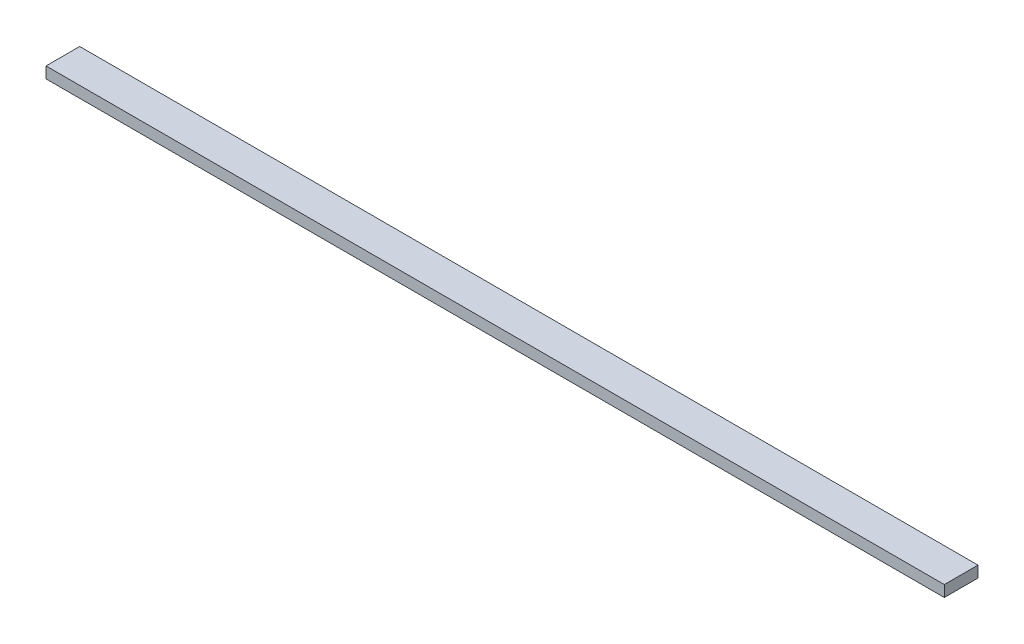
ISO-10303-21;
HEADER;
FILE_DESCRIPTION(('STEP AP214'),'2;1');
FILE_NAME('part.step','',(''),(''),'','','');
FILE_SCHEMA(('AUTOMOTIVE_DESIGN { 1 0 10303 214 1 1 1 1 }'));
ENDSEC;
DATA;
#1=APPLICATION_CONTEXT('core data for automotive mechanical design processes');
#2=APPLICATION_PROTOCOL_DEFINITION('international standard','automotive_design',2000,#1);
#3=PRODUCT_CONTEXT('',#1,'mechanical');
#4=PRODUCT('Part','Part','',(#3));
#5=PRODUCT_RELATED_PRODUCT_CATEGORY('part','',(#4));
#6=PRODUCT_DEFINITION_FORMATION('','',#4);
#7=PRODUCT_DEFINITION_CONTEXT('part definition',#1,'design');
#8=PRODUCT_DEFINITION('design','',#6,#7);
#9=PRODUCT_DEFINITION_SHAPE('','',#8);
#10=(LENGTH_UNIT() NAMED_UNIT(*) SI_UNIT(.MILLI.,.METRE.));
#11=(NAMED_UNIT(*) PLANE_ANGLE_UNIT() SI_UNIT($,.RADIAN.));
#12=(NAMED_UNIT(*) SI_UNIT($,.STERADIAN.) SOLID_ANGLE_UNIT());
#13=UNCERTAINTY_MEASURE_WITH_UNIT(LENGTH_MEASURE(1.E-05),#10,'distance_accuracy_value','');
#14=(GEOMETRIC_REPRESENTATION_CONTEXT(3) GLOBAL_UNCERTAINTY_ASSIGNED_CONTEXT((#13)) GLOBAL_UNIT_ASSIGNED_CONTEXT((#10,
#11,#12)) REPRESENTATION_CONTEXT('',''));
#15=CARTESIAN_POINT('',(0.,0.,0.));
#16=DIRECTION('',(0.,0.,1.));
#17=DIRECTION('',(1.,0.,0.));
#18=AXIS2_PLACEMENT_3D('',#15,#16,#17);
#19=CARTESIAN_POINT('',(-400.,10.,-15.));
#20=DIRECTION('',(1.,0.,0.));
#21=DIRECTION('',(0.,0.,-1.));
#22=AXIS2_PLACEMENT_3D('',#19,#20,#21);
#23=PLANE('',#22);
#24=DIRECTION('',(0.,0.,1.));
#25=VECTOR('',#24,1.);
#26=CARTESIAN_POINT('',(-400.,0.,-15.));
#27=LINE('',#26,#25);
#28=CARTESIAN_POINT('',(-400.,0.,-15.));
#29=VERTEX_POINT('',#28);
#30=CARTESIAN_POINT('',(-400.,0.,15.));
#31=VERTEX_POINT('',#30);
#32=EDGE_CURVE('E95',#29,#31,#27,.T.);
#33=ORIENTED_EDGE('',*,*,#32,.T.);
#34=DIRECTION('',(0.,-1.,0.));
#35=VECTOR('',#34,1.);
#36=CARTESIAN_POINT('',(-400.,10.,15.));
#37=LINE('',#36,#35);
#38=CARTESIAN_POINT('',(-400.,10.,15.));
#39=VERTEX_POINT('',#38);
#40=EDGE_CURVE('E11',#39,#31,#37,.T.);
#41=ORIENTED_EDGE('',*,*,#40,.F.);
#42=DIRECTION('',(0.,0.,1.));
#43=VECTOR('',#42,1.);
#44=CARTESIAN_POINT('',(-400.,10.,-15.));
#45=LINE('',#44,#43);
#46=CARTESIAN_POINT('',(-400.,10.,-15.));
#47=VERTEX_POINT('',#46);
#48=EDGE_CURVE('E83',#47,#39,#45,.T.);
#49=ORIENTED_EDGE('',*,*,#48,.F.);
#50=DIRECTION('',(0.,-1.,0.));
#51=VECTOR('',#50,1.);
#52=CARTESIAN_POINT('',(-400.,10.,-15.));
#53=LINE('',#52,#51);
#54=EDGE_CURVE('E91',#47,#29,#53,.T.);
#55=ORIENTED_EDGE('',*,*,#54,.T.);
#56=EDGE_LOOP('',(#33,#41,#49,#55));
#57=FACE_BOUND('',#56,.T.);
#58=ADVANCED_FACE('F32',(#57),#23,.F.);
#59=CARTESIAN_POINT('',(-400.,10.,15.));
#60=DIRECTION('',(0.,0.,-1.));
#61=DIRECTION('',(-1.,0.,0.));
#62=AXIS2_PLACEMENT_3D('',#59,#60,#61);
#63=PLANE('',#62);
#64=DIRECTION('',(1.,0.,0.));
#65=VECTOR('',#64,1.);
#66=CARTESIAN_POINT('',(-400.,0.,15.));
#67=LINE('',#66,#65);
#68=CARTESIAN_POINT('',(400.,0.,15.));
#69=VERTEX_POINT('',#68);
#70=EDGE_CURVE('E87',#31,#69,#67,.T.);
#71=ORIENTED_EDGE('',*,*,#70,.T.);
#72=DIRECTION('',(0.,-1.,0.));
#73=VECTOR('',#72,1.);
#74=CARTESIAN_POINT('',(400.,10.,15.));
#75=LINE('',#74,#73);
#76=CARTESIAN_POINT('',(400.,10.,15.));
#77=VERTEX_POINT('',#76);
#78=EDGE_CURVE('E40',#77,#69,#75,.T.);
#79=ORIENTED_EDGE('',*,*,#78,.F.);
#80=DIRECTION('',(1.,0.,0.));
#81=VECTOR('',#80,1.);
#82=CARTESIAN_POINT('',(-400.,10.,15.));
#83=LINE('',#82,#81);
#84=EDGE_CURVE('E78',#39,#77,#83,.T.);
#85=ORIENTED_EDGE('',*,*,#84,.F.);
#86=ORIENTED_EDGE('',*,*,#40,.T.);
#87=EDGE_LOOP('',(#71,#79,#85,#86));
#88=FACE_BOUND('',#87,.T.);
#89=ADVANCED_FACE('F86',(#88),#63,.F.);
#90=CARTESIAN_POINT('',(400.,10.,-15.));
#91=DIRECTION('',(-1.,0.,0.));
#92=DIRECTION('',(0.,0.,1.));
#93=AXIS2_PLACEMENT_3D('',#90,#91,#92);
#94=PLANE('',#93);
#95=DIRECTION('',(0.,0.,-1.));
#96=VECTOR('',#95,1.);
#97=CARTESIAN_POINT('',(400.,0.,-15.));
#98=LINE('',#97,#96);
#99=CARTESIAN_POINT('',(400.,0.,-15.));
#100=VERTEX_POINT('',#99);
#101=EDGE_CURVE('E65',#69,#100,#98,.T.);
#102=ORIENTED_EDGE('',*,*,#101,.T.);
#103=DIRECTION('',(0.,-1.,0.));
#104=VECTOR('',#103,1.);
#105=CARTESIAN_POINT('',(400.,10.,-15.));
#106=LINE('',#105,#104);
#107=CARTESIAN_POINT('',(400.,10.,-15.));
#108=VERTEX_POINT('',#107);
#109=EDGE_CURVE('E88',#108,#100,#106,.T.);
#110=ORIENTED_EDGE('',*,*,#109,.F.);
#111=DIRECTION('',(0.,0.,-1.));
#112=VECTOR('',#111,1.);
#113=CARTESIAN_POINT('',(400.,10.,-15.));
#114=LINE('',#113,#112);
#115=EDGE_CURVE('E81',#77,#108,#114,.T.);
#116=ORIENTED_EDGE('',*,*,#115,.F.);
#117=ORIENTED_EDGE('',*,*,#78,.T.);
#118=EDGE_LOOP('',(#102,#110,#116,#117));
#119=FACE_BOUND('',#118,.T.);
#120=ADVANCED_FACE('F89',(#119),#94,.F.);
#121=CARTESIAN_POINT('',(-400.,10.,-15.));
#122=DIRECTION('',(0.,0.,1.));
#123=DIRECTION('',(1.,0.,0.));
#124=AXIS2_PLACEMENT_3D('',#121,#122,#123);
#125=PLANE('',#124);
#126=DIRECTION('',(-1.,0.,0.));
#127=VECTOR('',#126,1.);
#128=CARTESIAN_POINT('',(-400.,0.,-15.));
#129=LINE('',#128,#127);
#130=EDGE_CURVE('E71',#100,#29,#129,.T.);
#131=ORIENTED_EDGE('',*,*,#130,.T.);
#132=ORIENTED_EDGE('',*,*,#54,.F.);
#133=DIRECTION('',(-1.,0.,0.));
#134=VECTOR('',#133,1.);
#135=CARTESIAN_POINT('',(-400.,10.,-15.));
#136=LINE('',#135,#134);
#137=EDGE_CURVE('E48',#108,#47,#136,.T.);
#138=ORIENTED_EDGE('',*,*,#137,.F.);
#139=ORIENTED_EDGE('',*,*,#109,.T.);
#140=EDGE_LOOP('',(#131,#132,#138,#139));
#141=FACE_BOUND('',#140,.T.);
#142=ADVANCED_FACE('F102',(#141),#125,.F.);
#143=CARTESIAN_POINT('',(0.,10.,0.));
#144=DIRECTION('',(0.,1.,0.));
#145=DIRECTION('',(0.,0.,1.));
#146=AXIS2_PLACEMENT_3D('',#143,#144,#145);
#147=PLANE('',#146);
#148=ORIENTED_EDGE('',*,*,#48,.T.);
#149=ORIENTED_EDGE('',*,*,#84,.T.);
#150=ORIENTED_EDGE('',*,*,#115,.T.);
#151=ORIENTED_EDGE('',*,*,#137,.T.);
#152=EDGE_LOOP('',(#148,#149,#150,#151));
#153=FACE_BOUND('',#152,.T.);
#154=ADVANCED_FACE('F79',(#153),#147,.T.);
#155=CARTESIAN_POINT('',(0.,0.,0.));
#156=DIRECTION('',(0.,1.,0.));
#157=DIRECTION('',(0.,0.,1.));
#158=AXIS2_PLACEMENT_3D('',#155,#156,#157);
#159=PLANE('',#158);
#160=ORIENTED_EDGE('',*,*,#32,.F.);
#161=ORIENTED_EDGE('',*,*,#130,.F.);
#162=ORIENTED_EDGE('',*,*,#101,.F.);
#163=ORIENTED_EDGE('',*,*,#70,.F.);
#164=EDGE_LOOP('',(#160,#161,#162,#163));
#165=FACE_BOUND('',#164,.T.);
#166=ADVANCED_FACE('F105',(#165),#159,.F.);
#167=CLOSED_SHELL('',(#58,#89,#120,#142,#154,#166));
#168=MANIFOLD_SOLID_BREP('B2',#167);
#169=ADVANCED_BREP_SHAPE_REPRESENTATION('',(#18,#168),#14);
#170=SHAPE_DEFINITION_REPRESENTATION(#9,#169);
ENDSEC;
END-ISO-10303-21;
